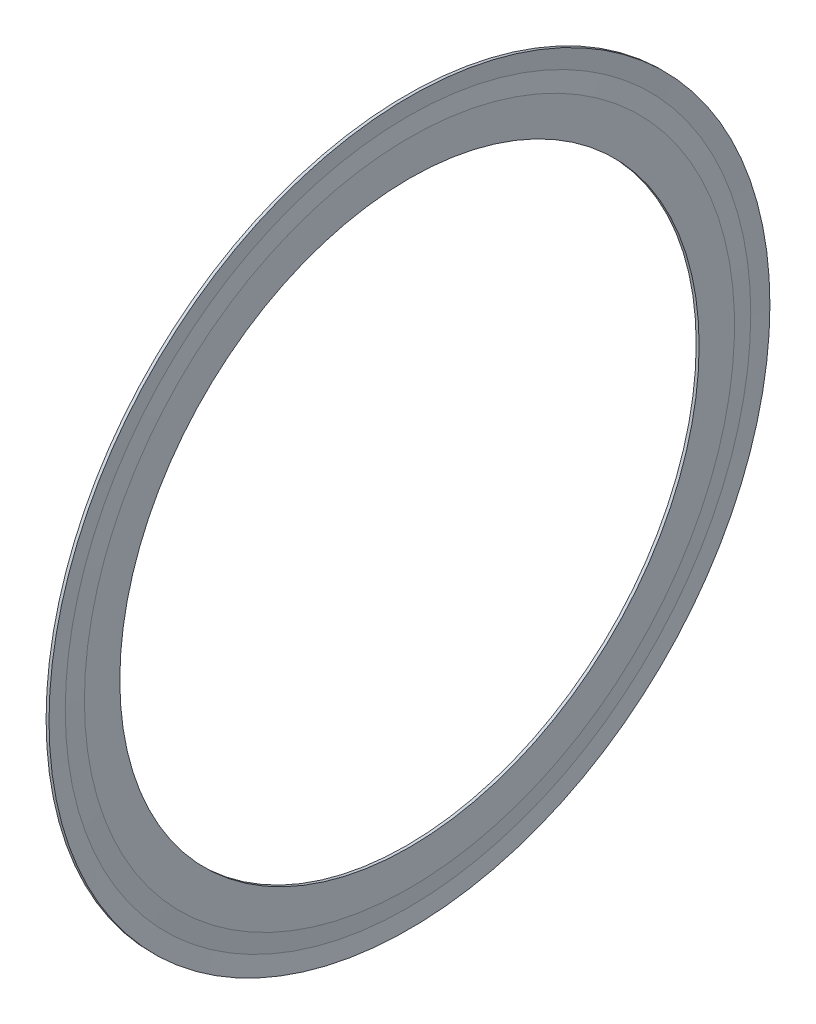
ISO-10303-21;
HEADER;
FILE_DESCRIPTION(('STEP AP214'),'2;1');
FILE_NAME('part.step','',(''),(''),'','','');
FILE_SCHEMA(('AUTOMOTIVE_DESIGN { 1 0 10303 214 1 1 1 1 }'));
ENDSEC;
DATA;
#1=APPLICATION_CONTEXT('core data for automotive mechanical design processes');
#2=APPLICATION_PROTOCOL_DEFINITION('international standard','automotive_design',2000,#1);
#3=PRODUCT_CONTEXT('',#1,'mechanical');
#4=PRODUCT('Part','Part','',(#3));
#5=PRODUCT_RELATED_PRODUCT_CATEGORY('part','',(#4));
#6=PRODUCT_DEFINITION_FORMATION('','',#4);
#7=PRODUCT_DEFINITION_CONTEXT('part definition',#1,'design');
#8=PRODUCT_DEFINITION('design','',#6,#7);
#9=PRODUCT_DEFINITION_SHAPE('','',#8);
#10=(LENGTH_UNIT() NAMED_UNIT(*) SI_UNIT(.MILLI.,.METRE.));
#11=(NAMED_UNIT(*) PLANE_ANGLE_UNIT() SI_UNIT($,.RADIAN.));
#12=(NAMED_UNIT(*) SI_UNIT($,.STERADIAN.) SOLID_ANGLE_UNIT());
#13=UNCERTAINTY_MEASURE_WITH_UNIT(LENGTH_MEASURE(1.E-05),#10,'distance_accuracy_value','');
#14=(GEOMETRIC_REPRESENTATION_CONTEXT(3) GLOBAL_UNCERTAINTY_ASSIGNED_CONTEXT((#13)) GLOBAL_UNIT_ASSIGNED_CONTEXT((#10,
#11,#12)) REPRESENTATION_CONTEXT('',''));
#15=CARTESIAN_POINT('',(0.,0.,0.));
#16=DIRECTION('',(0.,0.,1.));
#17=DIRECTION('',(1.,0.,0.));
#18=AXIS2_PLACEMENT_3D('',#15,#16,#17);
#19=CARTESIAN_POINT('',(4.64,0.,0.));
#20=DIRECTION('',(1.,0.,0.));
#21=DIRECTION('',(0.,0.,-1.));
#22=AXIS2_PLACEMENT_3D('',#19,#20,#21);
#23=CONICAL_SURFACE('',#22,11.075,1.40676621714642);
#24=CARTESIAN_POINT('',(4.55,0.,0.));
#25=DIRECTION('',(-1.,0.,0.));
#26=DIRECTION('',(0.,0.,1.));
#27=AXIS2_PLACEMENT_3D('',#24,#25,#26);
#28=CIRCLE('',#27,10.53125);
#29=CARTESIAN_POINT('',(4.55,0.,10.53125));
#30=VERTEX_POINT('',#29);
#31=EDGE_CURVE('E10',#30,#30,#28,.T.);
#32=ORIENTED_EDGE('',*,*,#31,.F.);
#33=EDGE_LOOP('',(#32));
#34=FACE_BOUND('',#33,.T.);
#35=CARTESIAN_POINT('',(4.64,0.,0.));
#36=DIRECTION('',(-1.,0.,0.));
#37=DIRECTION('',(0.,0.,1.));
#38=AXIS2_PLACEMENT_3D('',#35,#36,#37);
#39=CIRCLE('',#38,11.075);
#40=CARTESIAN_POINT('',(4.64,0.,11.075));
#41=VERTEX_POINT('',#40);
#42=EDGE_CURVE('E61',#41,#41,#39,.T.);
#43=ORIENTED_EDGE('',*,*,#42,.T.);
#44=EDGE_LOOP('',(#43));
#45=FACE_BOUND('',#44,.T.);
#46=ADVANCED_FACE('F33',(#34,#45),#23,.T.);
#47=CARTESIAN_POINT('',(4.55,10.53125,0.));
#48=DIRECTION('',(1.,0.,0.));
#49=DIRECTION('',(0.,0.,-1.));
#50=AXIS2_PLACEMENT_3D('',#47,#48,#49);
#51=PLANE('',#50);
#52=CARTESIAN_POINT('',(4.55,0.,0.));
#53=DIRECTION('',(-1.,0.,0.));
#54=DIRECTION('',(0.,0.,1.));
#55=AXIS2_PLACEMENT_3D('',#52,#53,#54);
#56=CIRCLE('',#55,9.9875);
#57=CARTESIAN_POINT('',(4.55,0.,9.9875));
#58=VERTEX_POINT('',#57);
#59=EDGE_CURVE('E39',#58,#58,#56,.T.);
#60=ORIENTED_EDGE('',*,*,#59,.F.);
#61=EDGE_LOOP('',(#60));
#62=FACE_BOUND('',#61,.T.);
#63=ORIENTED_EDGE('',*,*,#31,.T.);
#64=EDGE_LOOP('',(#63));
#65=FACE_BOUND('',#64,.T.);
#66=ADVANCED_FACE('F98',(#62,#65),#51,.F.);
#67=CARTESIAN_POINT('',(4.55,0.,0.));
#68=DIRECTION('',(-1.,0.,0.));
#69=DIRECTION('',(0.,0.,1.));
#70=AXIS2_PLACEMENT_3D('',#67,#68,#69);
#71=CONICAL_SURFACE('',#70,9.9875,1.48822587110018);
#72=CARTESIAN_POINT('',(4.64,0.,0.));
#73=DIRECTION('',(-1.,0.,0.));
#74=DIRECTION('',(0.,0.,1.));
#75=AXIS2_PLACEMENT_3D('',#72,#73,#74);
#76=CIRCLE('',#75,8.9);
#77=CARTESIAN_POINT('',(4.64,0.,8.9));
#78=VERTEX_POINT('',#77);
#79=EDGE_CURVE('E43',#78,#78,#76,.T.);
#80=ORIENTED_EDGE('',*,*,#79,.F.);
#81=EDGE_LOOP('',(#80));
#82=FACE_BOUND('',#81,.T.);
#83=ORIENTED_EDGE('',*,*,#59,.T.);
#84=EDGE_LOOP('',(#83));
#85=FACE_BOUND('',#84,.T.);
#86=ADVANCED_FACE('F93',(#82,#85),#71,.F.);
#87=CARTESIAN_POINT('',(50.,0.,0.));
#88=DIRECTION('',(-1.,0.,0.));
#89=DIRECTION('',(0.,0.,1.));
#90=AXIS2_PLACEMENT_3D('',#87,#88,#89);
#91=CYLINDRICAL_SURFACE('',#90,8.9);
#92=CARTESIAN_POINT('',(4.73,0.,0.));
#93=DIRECTION('',(-1.,0.,0.));
#94=DIRECTION('',(0.,0.,1.));
#95=AXIS2_PLACEMENT_3D('',#92,#93,#94);
#96=CIRCLE('',#95,8.9);
#97=CARTESIAN_POINT('',(4.73,0.,8.9));
#98=VERTEX_POINT('',#97);
#99=EDGE_CURVE('E47',#98,#98,#96,.T.);
#100=ORIENTED_EDGE('',*,*,#99,.F.);
#101=EDGE_LOOP('',(#100));
#102=FACE_BOUND('',#101,.T.);
#103=ORIENTED_EDGE('',*,*,#79,.T.);
#104=EDGE_LOOP('',(#103));
#105=FACE_BOUND('',#104,.T.);
#106=ADVANCED_FACE('F87',(#102,#105),#91,.F.);
#107=CARTESIAN_POINT('',(4.73,8.9,0.));
#108=DIRECTION('',(-1.,0.,0.));
#109=DIRECTION('',(0.,0.,1.));
#110=AXIS2_PLACEMENT_3D('',#107,#108,#109);
#111=PLANE('',#110);
#112=CARTESIAN_POINT('',(4.73,0.,0.));
#113=DIRECTION('',(-1.,0.,0.));
#114=DIRECTION('',(0.,0.,1.));
#115=AXIS2_PLACEMENT_3D('',#112,#113,#114);
#116=CIRCLE('',#115,9.9875);
#117=CARTESIAN_POINT('',(4.73,0.,9.9875));
#118=VERTEX_POINT('',#117);
#119=EDGE_CURVE('E52',#118,#118,#116,.T.);
#120=ORIENTED_EDGE('',*,*,#119,.F.);
#121=EDGE_LOOP('',(#120));
#122=FACE_BOUND('',#121,.T.);
#123=ORIENTED_EDGE('',*,*,#99,.T.);
#124=EDGE_LOOP('',(#123));
#125=FACE_BOUND('',#124,.T.);
#126=ADVANCED_FACE('F81',(#122,#125),#111,.F.);
#127=CARTESIAN_POINT('',(4.73,0.,0.));
#128=DIRECTION('',(-1.,0.,0.));
#129=DIRECTION('',(0.,0.,1.));
#130=AXIS2_PLACEMENT_3D('',#127,#128,#129);
#131=CONICAL_SURFACE('',#130,9.9875,1.48822587110019);
#132=CARTESIAN_POINT('',(4.685,0.,0.));
#133=DIRECTION('',(-1.,0.,0.));
#134=DIRECTION('',(0.,0.,1.));
#135=AXIS2_PLACEMENT_3D('',#132,#133,#134);
#136=CIRCLE('',#135,10.53125);
#137=CARTESIAN_POINT('',(4.685,0.,10.53125));
#138=VERTEX_POINT('',#137);
#139=EDGE_CURVE('E55',#138,#138,#136,.T.);
#140=ORIENTED_EDGE('',*,*,#139,.F.);
#141=EDGE_LOOP('',(#140));
#142=FACE_BOUND('',#141,.T.);
#143=ORIENTED_EDGE('',*,*,#119,.T.);
#144=EDGE_LOOP('',(#143));
#145=FACE_BOUND('',#144,.T.);
#146=ADVANCED_FACE('F75',(#142,#145),#131,.T.);
#147=CARTESIAN_POINT('',(4.685,0.,0.));
#148=DIRECTION('',(1.,0.,0.));
#149=DIRECTION('',(0.,0.,-1.));
#150=AXIS2_PLACEMENT_3D('',#147,#148,#149);
#151=CONICAL_SURFACE('',#150,10.53125,1.48822587110019);
#152=CARTESIAN_POINT('',(4.73,0.,0.));
#153=DIRECTION('',(-1.,0.,0.));
#154=DIRECTION('',(0.,0.,1.));
#155=AXIS2_PLACEMENT_3D('',#152,#153,#154);
#156=CIRCLE('',#155,11.075);
#157=CARTESIAN_POINT('',(4.73,0.,11.075));
#158=VERTEX_POINT('',#157);
#159=EDGE_CURVE('E58',#158,#158,#156,.T.);
#160=ORIENTED_EDGE('',*,*,#159,.F.);
#161=EDGE_LOOP('',(#160));
#162=FACE_BOUND('',#161,.T.);
#163=ORIENTED_EDGE('',*,*,#139,.T.);
#164=EDGE_LOOP('',(#163));
#165=FACE_BOUND('',#164,.T.);
#166=ADVANCED_FACE('F69',(#162,#165),#151,.F.);
#167=CARTESIAN_POINT('',(50.,0.,0.));
#168=DIRECTION('',(-1.,0.,0.));
#169=DIRECTION('',(0.,0.,1.));
#170=AXIS2_PLACEMENT_3D('',#167,#168,#169);
#171=CYLINDRICAL_SURFACE('',#170,11.075);
#172=ORIENTED_EDGE('',*,*,#42,.F.);
#173=EDGE_LOOP('',(#172));
#174=FACE_BOUND('',#173,.T.);
#175=ORIENTED_EDGE('',*,*,#159,.T.);
#176=EDGE_LOOP('',(#175));
#177=FACE_BOUND('',#176,.T.);
#178=ADVANCED_FACE('F66',(#174,#177),#171,.T.);
#179=CLOSED_SHELL('',(#46,#66,#86,#106,#126,#146,#166,#178));
#180=MANIFOLD_SOLID_BREP('B2',#179);
#181=ADVANCED_BREP_SHAPE_REPRESENTATION('',(#18,#180),#14);
#182=SHAPE_DEFINITION_REPRESENTATION(#9,#181);
ENDSEC;
END-ISO-10303-21;
